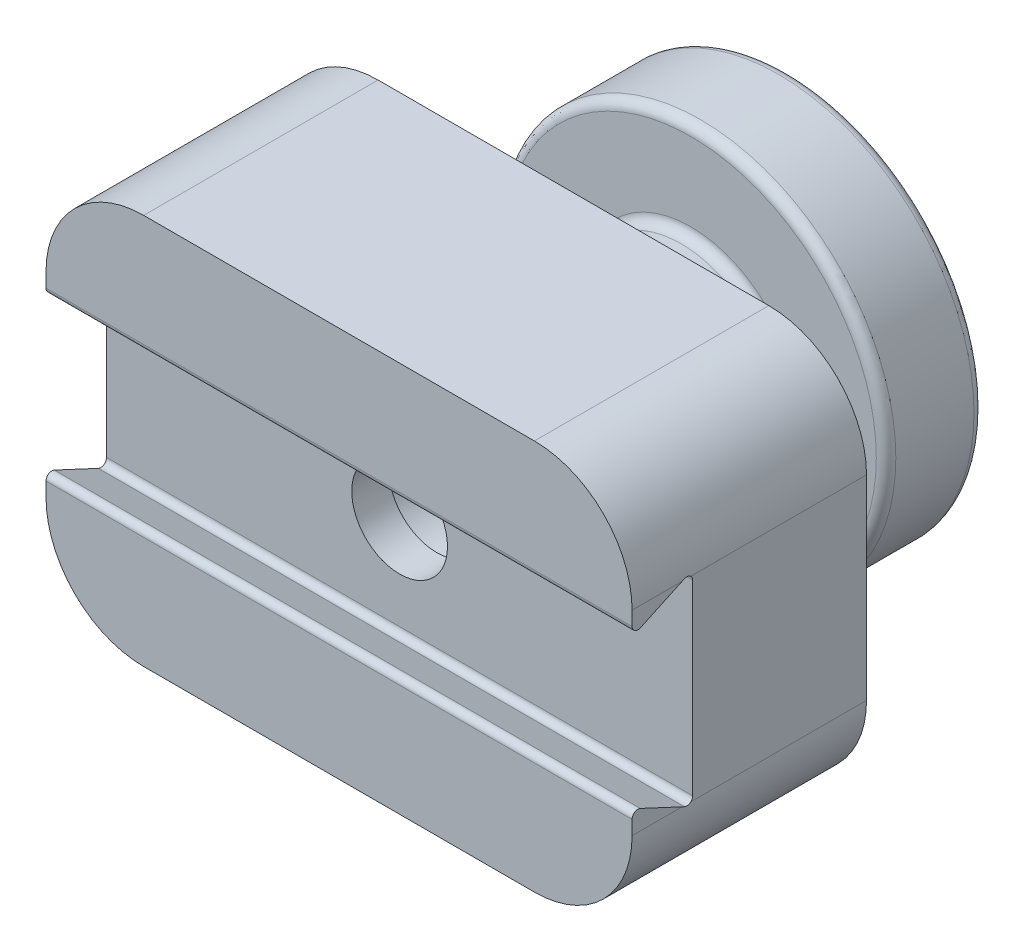
ISO-10303-21;
HEADER;
FILE_DESCRIPTION(('STEP AP214'),'2;1');
FILE_NAME('part.step','',(''),(''),'','','');
FILE_SCHEMA(('AUTOMOTIVE_DESIGN { 1 0 10303 214 1 1 1 1 }'));
ENDSEC;
DATA;
#1=APPLICATION_CONTEXT('core data for automotive mechanical design processes');
#2=APPLICATION_PROTOCOL_DEFINITION('international standard','automotive_design',2000,#1);
#3=PRODUCT_CONTEXT('',#1,'mechanical');
#4=PRODUCT('Part','Part','',(#3));
#5=PRODUCT_RELATED_PRODUCT_CATEGORY('part','',(#4));
#6=PRODUCT_DEFINITION_FORMATION('','',#4);
#7=PRODUCT_DEFINITION_CONTEXT('part definition',#1,'design');
#8=PRODUCT_DEFINITION('design','',#6,#7);
#9=PRODUCT_DEFINITION_SHAPE('','',#8);
#10=(LENGTH_UNIT() NAMED_UNIT(*) SI_UNIT(.MILLI.,.METRE.));
#11=(NAMED_UNIT(*) PLANE_ANGLE_UNIT() SI_UNIT($,.RADIAN.));
#12=(NAMED_UNIT(*) SI_UNIT($,.STERADIAN.) SOLID_ANGLE_UNIT());
#13=UNCERTAINTY_MEASURE_WITH_UNIT(LENGTH_MEASURE(1.E-05),#10,'distance_accuracy_value','');
#14=(GEOMETRIC_REPRESENTATION_CONTEXT(3) GLOBAL_UNCERTAINTY_ASSIGNED_CONTEXT((#13)) GLOBAL_UNIT_ASSIGNED_CONTEXT((#10,
#11,#12)) REPRESENTATION_CONTEXT('',''));
#15=CARTESIAN_POINT('',(0.,0.,0.));
#16=DIRECTION('',(0.,0.,1.));
#17=DIRECTION('',(1.,0.,0.));
#18=AXIS2_PLACEMENT_3D('',#15,#16,#17);
#19=CARTESIAN_POINT('',(-15.,10.,23.));
#20=DIRECTION('',(1.,0.,0.));
#21=DIRECTION('',(0.,1.,0.));
#22=AXIS2_PLACEMENT_3D('',#19,#20,#21);
#23=PLANE('',#22);
#24=DIRECTION('',(0.,-1.,0.));
#25=VECTOR('',#24,1.);
#26=CARTESIAN_POINT('',(-15.,10.,23.));
#27=LINE('',#26,#25);
#28=CARTESIAN_POINT('',(-15.,5.,23.));
#29=VERTEX_POINT('',#28);
#30=CARTESIAN_POINT('',(-15.,4.27535193285474,23.));
#31=VERTEX_POINT('',#30);
#32=EDGE_CURVE('E511',#29,#31,#27,.T.);
#33=ORIENTED_EDGE('',*,*,#32,.F.);
#34=DIRECTION('',(0.,0.,-1.));
#35=VECTOR('',#34,1.);
#36=CARTESIAN_POINT('',(-15.,5.,23.));
#37=LINE('',#36,#35);
#38=CARTESIAN_POINT('',(-15.,5.,20.4361267301274));
#39=VERTEX_POINT('',#38);
#40=EDGE_CURVE('E358',#29,#39,#37,.T.);
#41=ORIENTED_EDGE('',*,*,#40,.T.);
#42=DIRECTION('',(0.,-0.422618261740704,0.906307787036648));
#43=VECTOR('',#42,1.);
#44=CARTESIAN_POINT('',(-15.,3.80444625971949,23.));
#45=LINE('',#44,#43);
#46=CARTESIAN_POINT('',(-15.,4.00345959674374,22.5732145214778));
#47=VERTEX_POINT('',#46);
#48=EDGE_CURVE('E202',#39,#47,#45,.T.);
#49=ORIENTED_EDGE('',*,*,#48,.T.);
#50=CARTESIAN_POINT('',(-15.,4.27535193285474,22.7));
#51=DIRECTION('',(1.,0.,0.));
#52=DIRECTION('',(0.,1.,0.));
#53=AXIS2_PLACEMENT_3D('',#50,#51,#52);
#54=CIRCLE('',#53,0.3);
#55=EDGE_CURVE('E507',#47,#31,#54,.F.);
#56=ORIENTED_EDGE('',*,*,#55,.T.);
#57=EDGE_LOOP('',(#33,#41,#49,#56));
#58=FACE_BOUND('',#57,.T.);
#59=ADVANCED_FACE('F41',(#58),#23,.F.);
#60=CARTESIAN_POINT('',(-15.,4.77909432686475,20.2));
#61=DIRECTION('',(1.,0.,0.));
#62=DIRECTION('',(0.,1.,0.));
#63=AXIS2_PLACEMENT_3D('',#60,#61,#62);
#64=CIRCLE('',#63,0.3);
#65=CARTESIAN_POINT('',(-15.,4.77909432686475,19.9));
#66=VERTEX_POINT('',#65);
#67=CARTESIAN_POINT('',(-15.,5.,19.9970204848349));
#68=VERTEX_POINT('',#67);
#69=EDGE_CURVE('E227',#66,#68,#64,.T.);
#70=ORIENTED_EDGE('',*,*,#69,.T.);
#71=DIRECTION('',(0.,0.,-1.));
#72=VECTOR('',#71,1.);
#73=CARTESIAN_POINT('',(-15.,5.,23.));
#74=LINE('',#73,#72);
#75=CARTESIAN_POINT('',(-15.,5.,11.));
#76=VERTEX_POINT('',#75);
#77=EDGE_CURVE('E352',#68,#76,#74,.T.);
#78=ORIENTED_EDGE('',*,*,#77,.T.);
#79=DIRECTION('',(0.,-1.,0.));
#80=VECTOR('',#79,1.);
#81=CARTESIAN_POINT('',(-15.,10.,11.));
#82=LINE('',#81,#80);
#83=CARTESIAN_POINT('',(-15.,-5.,11.));
#84=VERTEX_POINT('',#83);
#85=EDGE_CURVE('E489',#76,#84,#82,.T.);
#86=ORIENTED_EDGE('',*,*,#85,.T.);
#87=DIRECTION('',(0.,0.,-1.));
#88=VECTOR('',#87,1.);
#89=CARTESIAN_POINT('',(-15.,-5.,23.));
#90=LINE('',#89,#88);
#91=CARTESIAN_POINT('',(-15.,-5.,19.9970204848349));
#92=VERTEX_POINT('',#91);
#93=EDGE_CURVE('E349',#84,#92,#90,.F.);
#94=ORIENTED_EDGE('',*,*,#93,.T.);
#95=CARTESIAN_POINT('',(-15.,-4.77909432686475,20.2));
#96=DIRECTION('',(1.,0.,0.));
#97=DIRECTION('',(0.,1.,0.));
#98=AXIS2_PLACEMENT_3D('',#95,#96,#97);
#99=CIRCLE('',#98,0.3);
#100=CARTESIAN_POINT('',(-15.,-4.77909432686474,19.9));
#101=VERTEX_POINT('',#100);
#102=EDGE_CURVE('E222',#92,#101,#99,.T.);
#103=ORIENTED_EDGE('',*,*,#102,.T.);
#104=DIRECTION('',(0.,1.,0.));
#105=VECTOR('',#104,1.);
#106=CARTESIAN_POINT('',(-15.,5.25,19.9));
#107=LINE('',#106,#105);
#108=EDGE_CURVE('E341',#101,#66,#107,.T.);
#109=ORIENTED_EDGE('',*,*,#108,.T.);
#110=EDGE_LOOP('',(#70,#78,#86,#94,#103,#109));
#111=FACE_BOUND('',#110,.T.);
#112=ADVANCED_FACE('F312',(#111),#23,.F.);
#113=CARTESIAN_POINT('',(15.,10.,23.));
#114=DIRECTION('',(-1.,0.,0.));
#115=DIRECTION('',(0.,-1.,0.));
#116=AXIS2_PLACEMENT_3D('',#113,#114,#115);
#117=PLANE('',#116);
#118=DIRECTION('',(0.,1.,0.));
#119=VECTOR('',#118,1.);
#120=CARTESIAN_POINT('',(15.,10.,23.));
#121=LINE('',#120,#119);
#122=CARTESIAN_POINT('',(15.,-5.,23.));
#123=VERTEX_POINT('',#122);
#124=CARTESIAN_POINT('',(15.,-4.27535193285473,23.));
#125=VERTEX_POINT('',#124);
#126=EDGE_CURVE('E442',#123,#125,#121,.T.);
#127=ORIENTED_EDGE('',*,*,#126,.F.);
#128=DIRECTION('',(0.,0.,-1.));
#129=VECTOR('',#128,1.);
#130=CARTESIAN_POINT('',(15.,-5.,23.));
#131=LINE('',#130,#129);
#132=CARTESIAN_POINT('',(15.,-5.,20.4361267301274));
#133=VERTEX_POINT('',#132);
#134=EDGE_CURVE('E200',#123,#133,#131,.T.);
#135=ORIENTED_EDGE('',*,*,#134,.T.);
#136=DIRECTION('',(0.,-0.422618261740705,-0.906307787036648));
#137=VECTOR('',#136,1.);
#138=CARTESIAN_POINT('',(15.,-5.25,19.9));
#139=LINE('',#138,#137);
#140=CARTESIAN_POINT('',(15.,-4.00345959674374,22.5732145214778));
#141=VERTEX_POINT('',#140);
#142=EDGE_CURVE('E184',#141,#133,#139,.T.);
#143=ORIENTED_EDGE('',*,*,#142,.F.);
#144=CARTESIAN_POINT('',(15.,-4.27535193285473,22.7));
#145=DIRECTION('',(-1.,0.,0.));
#146=DIRECTION('',(0.,-1.,0.));
#147=AXIS2_PLACEMENT_3D('',#144,#145,#146);
#148=CIRCLE('',#147,0.3);
#149=EDGE_CURVE('E197',#141,#125,#148,.F.);
#150=ORIENTED_EDGE('',*,*,#149,.T.);
#151=EDGE_LOOP('',(#127,#135,#143,#150));
#152=FACE_BOUND('',#151,.T.);
#153=ADVANCED_FACE('F196',(#152),#117,.F.);
#154=CARTESIAN_POINT('',(15.,-4.77909432686475,20.2));
#155=DIRECTION('',(-1.,0.,0.));
#156=DIRECTION('',(0.,-1.,0.));
#157=AXIS2_PLACEMENT_3D('',#154,#155,#156);
#158=CIRCLE('',#157,0.3);
#159=CARTESIAN_POINT('',(15.,-4.77909432686474,19.9));
#160=VERTEX_POINT('',#159);
#161=CARTESIAN_POINT('',(15.,-5.,19.9970204848349));
#162=VERTEX_POINT('',#161);
#163=EDGE_CURVE('E224',#160,#162,#158,.T.);
#164=ORIENTED_EDGE('',*,*,#163,.T.);
#165=DIRECTION('',(0.,0.,-1.));
#166=VECTOR('',#165,1.);
#167=CARTESIAN_POINT('',(15.,-5.,23.));
#168=LINE('',#167,#166);
#169=CARTESIAN_POINT('',(15.,-5.,11.));
#170=VERTEX_POINT('',#169);
#171=EDGE_CURVE('E236',#162,#170,#168,.T.);
#172=ORIENTED_EDGE('',*,*,#171,.T.);
#173=DIRECTION('',(0.,1.,0.));
#174=VECTOR('',#173,1.);
#175=CARTESIAN_POINT('',(15.,10.,11.));
#176=LINE('',#175,#174);
#177=CARTESIAN_POINT('',(15.,5.,11.));
#178=VERTEX_POINT('',#177);
#179=EDGE_CURVE('E485',#170,#178,#176,.T.);
#180=ORIENTED_EDGE('',*,*,#179,.T.);
#181=DIRECTION('',(0.,0.,-1.));
#182=VECTOR('',#181,1.);
#183=CARTESIAN_POINT('',(15.,5.,23.));
#184=LINE('',#183,#182);
#185=CARTESIAN_POINT('',(15.,5.,19.9970204848349));
#186=VERTEX_POINT('',#185);
#187=EDGE_CURVE('E234',#178,#186,#184,.F.);
#188=ORIENTED_EDGE('',*,*,#187,.T.);
#189=CARTESIAN_POINT('',(15.,4.77909432686475,20.2));
#190=DIRECTION('',(-1.,0.,0.));
#191=DIRECTION('',(0.,-1.,0.));
#192=AXIS2_PLACEMENT_3D('',#189,#190,#191);
#193=CIRCLE('',#192,0.3);
#194=CARTESIAN_POINT('',(15.,4.77909432686475,19.9));
#195=VERTEX_POINT('',#194);
#196=EDGE_CURVE('E230',#186,#195,#193,.T.);
#197=ORIENTED_EDGE('',*,*,#196,.T.);
#198=DIRECTION('',(0.,1.,0.));
#199=VECTOR('',#198,1.);
#200=CARTESIAN_POINT('',(15.,5.25,19.9));
#201=LINE('',#200,#199);
#202=EDGE_CURVE('E201',#160,#195,#201,.T.);
#203=ORIENTED_EDGE('',*,*,#202,.F.);
#204=EDGE_LOOP('',(#164,#172,#180,#188,#197,#203));
#205=FACE_BOUND('',#204,.T.);
#206=ADVANCED_FACE('F334',(#205),#117,.F.);
#207=DIRECTION('',(0.,-0.422618261740704,0.906307787036648));
#208=VECTOR('',#207,1.);
#209=CARTESIAN_POINT('',(15.,3.80444625971949,23.));
#210=LINE('',#209,#208);
#211=CARTESIAN_POINT('',(15.,5.,20.4361267301274));
#212=VERTEX_POINT('',#211);
#213=CARTESIAN_POINT('',(15.,4.00345959674374,22.5732145214778));
#214=VERTEX_POINT('',#213);
#215=EDGE_CURVE('E518',#212,#214,#210,.T.);
#216=ORIENTED_EDGE('',*,*,#215,.F.);
#217=DIRECTION('',(0.,0.,-1.));
#218=VECTOR('',#217,1.);
#219=CARTESIAN_POINT('',(15.,5.,23.));
#220=LINE('',#219,#218);
#221=CARTESIAN_POINT('',(15.,5.,23.));
#222=VERTEX_POINT('',#221);
#223=EDGE_CURVE('E232',#212,#222,#220,.F.);
#224=ORIENTED_EDGE('',*,*,#223,.T.);
#225=CARTESIAN_POINT('',(15.,4.27535193285474,23.));
#226=VERTEX_POINT('',#225);
#227=EDGE_CURVE('E488',#226,#222,#121,.T.);
#228=ORIENTED_EDGE('',*,*,#227,.F.);
#229=CARTESIAN_POINT('',(15.,4.27535193285474,22.7));
#230=DIRECTION('',(-1.,0.,0.));
#231=DIRECTION('',(0.,-1.,0.));
#232=AXIS2_PLACEMENT_3D('',#229,#230,#231);
#233=CIRCLE('',#232,0.3);
#234=EDGE_CURVE('E208',#226,#214,#233,.F.);
#235=ORIENTED_EDGE('',*,*,#234,.T.);
#236=EDGE_LOOP('',(#216,#224,#228,#235));
#237=FACE_BOUND('',#236,.T.);
#238=ADVANCED_FACE('F325',(#237),#117,.F.);
#239=DIRECTION('',(0.,-0.422618261740705,-0.906307787036648));
#240=VECTOR('',#239,1.);
#241=CARTESIAN_POINT('',(-15.,-5.25,19.9));
#242=LINE('',#241,#240);
#243=CARTESIAN_POINT('',(-15.,-4.00345959674374,22.5732145214778));
#244=VERTEX_POINT('',#243);
#245=CARTESIAN_POINT('',(-15.,-5.,20.4361267301274));
#246=VERTEX_POINT('',#245);
#247=EDGE_CURVE('E186',#244,#246,#242,.T.);
#248=ORIENTED_EDGE('',*,*,#247,.T.);
#249=DIRECTION('',(0.,0.,-1.));
#250=VECTOR('',#249,1.);
#251=CARTESIAN_POINT('',(-15.,-5.,23.));
#252=LINE('',#251,#250);
#253=CARTESIAN_POINT('',(-15.,-5.,23.));
#254=VERTEX_POINT('',#253);
#255=EDGE_CURVE('E339',#246,#254,#252,.F.);
#256=ORIENTED_EDGE('',*,*,#255,.T.);
#257=CARTESIAN_POINT('',(-15.,-4.27535193285473,23.));
#258=VERTEX_POINT('',#257);
#259=EDGE_CURVE('E441',#258,#254,#27,.T.);
#260=ORIENTED_EDGE('',*,*,#259,.F.);
#261=CARTESIAN_POINT('',(-15.,-4.27535193285473,22.7));
#262=DIRECTION('',(1.,0.,0.));
#263=DIRECTION('',(0.,1.,0.));
#264=AXIS2_PLACEMENT_3D('',#261,#262,#263);
#265=CIRCLE('',#264,0.3);
#266=EDGE_CURVE('E214',#258,#244,#265,.F.);
#267=ORIENTED_EDGE('',*,*,#266,.T.);
#268=EDGE_LOOP('',(#248,#256,#260,#267));
#269=FACE_BOUND('',#268,.T.);
#270=ADVANCED_FACE('F315',(#269),#23,.F.);
#271=CARTESIAN_POINT('',(0.,0.,23.));
#272=DIRECTION('',(0.,0.,1.));
#273=DIRECTION('',(1.,0.,0.));
#274=AXIS2_PLACEMENT_3D('',#271,#272,#273);
#275=PLANE('',#274);
#276=DIRECTION('',(1.,0.,0.));
#277=VECTOR('',#276,1.);
#278=CARTESIAN_POINT('',(-15.,-10.,23.));
#279=LINE('',#278,#277);
#280=CARTESIAN_POINT('',(-10.,-10.,23.));
#281=VERTEX_POINT('',#280);
#282=CARTESIAN_POINT('',(9.99999999999999,-10.,23.));
#283=VERTEX_POINT('',#282);
#284=EDGE_CURVE('E190',#281,#283,#279,.T.);
#285=ORIENTED_EDGE('',*,*,#284,.T.);
#286=CARTESIAN_POINT('',(9.99999999999999,-5.,23.));
#287=DIRECTION('',(0.,0.,1.));
#288=DIRECTION('',(1.,0.,0.));
#289=AXIS2_PLACEMENT_3D('',#286,#287,#288);
#290=CIRCLE('',#289,5.);
#291=EDGE_CURVE('E449',#283,#123,#290,.T.);
#292=ORIENTED_EDGE('',*,*,#291,.T.);
#293=ORIENTED_EDGE('',*,*,#126,.T.);
#294=DIRECTION('',(-1.,0.,0.));
#295=VECTOR('',#294,1.);
#296=CARTESIAN_POINT('',(0.,-4.27535193285473,23.));
#297=LINE('',#296,#295);
#298=EDGE_CURVE('E206',#125,#258,#297,.T.);
#299=ORIENTED_EDGE('',*,*,#298,.T.);
#300=ORIENTED_EDGE('',*,*,#259,.T.);
#301=CARTESIAN_POINT('',(-10.,-5.,23.));
#302=DIRECTION('',(0.,0.,1.));
#303=DIRECTION('',(1.,0.,0.));
#304=AXIS2_PLACEMENT_3D('',#301,#302,#303);
#305=CIRCLE('',#304,5.);
#306=EDGE_CURVE('E348',#254,#281,#305,.T.);
#307=ORIENTED_EDGE('',*,*,#306,.T.);
#308=EDGE_LOOP('',(#285,#292,#293,#299,#300,#307));
#309=FACE_BOUND('',#308,.T.);
#310=ADVANCED_FACE('F324',(#309),#275,.T.);
#311=ORIENTED_EDGE('',*,*,#227,.T.);
#312=CARTESIAN_POINT('',(9.99999999999999,5.,23.));
#313=DIRECTION('',(0.,0.,1.));
#314=DIRECTION('',(1.,0.,0.));
#315=AXIS2_PLACEMENT_3D('',#312,#313,#314);
#316=CIRCLE('',#315,5.);
#317=CARTESIAN_POINT('',(9.99999999999999,10.,23.));
#318=VERTEX_POINT('',#317);
#319=EDGE_CURVE('E350',#222,#318,#316,.T.);
#320=ORIENTED_EDGE('',*,*,#319,.T.);
#321=DIRECTION('',(-1.,0.,0.));
#322=VECTOR('',#321,1.);
#323=CARTESIAN_POINT('',(-15.,10.,23.));
#324=LINE('',#323,#322);
#325=CARTESIAN_POINT('',(-10.,10.,23.));
#326=VERTEX_POINT('',#325);
#327=EDGE_CURVE('E434',#318,#326,#324,.T.);
#328=ORIENTED_EDGE('',*,*,#327,.T.);
#329=CARTESIAN_POINT('',(-10.,5.,23.));
#330=DIRECTION('',(0.,0.,1.));
#331=DIRECTION('',(1.,0.,0.));
#332=AXIS2_PLACEMENT_3D('',#329,#330,#331);
#333=CIRCLE('',#332,5.);
#334=EDGE_CURVE('E56',#326,#29,#333,.T.);
#335=ORIENTED_EDGE('',*,*,#334,.T.);
#336=ORIENTED_EDGE('',*,*,#32,.T.);
#337=DIRECTION('',(-1.,0.,0.));
#338=VECTOR('',#337,1.);
#339=CARTESIAN_POINT('',(0.,4.27535193285474,23.));
#340=LINE('',#339,#338);
#341=EDGE_CURVE('E220',#31,#226,#340,.F.);
#342=ORIENTED_EDGE('',*,*,#341,.T.);
#343=EDGE_LOOP('',(#311,#320,#328,#335,#336,#342));
#344=FACE_BOUND('',#343,.T.);
#345=ADVANCED_FACE('F331',(#344),#275,.T.);
#346=CARTESIAN_POINT('',(0.,0.,5.));
#347=DIRECTION('',(0.,0.,-1.));
#348=DIRECTION('',(-1.,0.,0.));
#349=AXIS2_PLACEMENT_3D('',#346,#347,#348);
#350=CYLINDRICAL_SURFACE('',#349,10.);
#351=CARTESIAN_POINT('',(0.,0.,0.5));
#352=DIRECTION('',(0.,0.,-1.));
#353=DIRECTION('',(-1.,0.,0.));
#354=AXIS2_PLACEMENT_3D('',#351,#352,#353);
#355=CIRCLE('',#354,10.);
#356=CARTESIAN_POINT('',(-10.,0.,0.5));
#357=VERTEX_POINT('',#356);
#358=EDGE_CURVE('E363',#357,#357,#355,.F.);
#359=ORIENTED_EDGE('',*,*,#358,.T.);
#360=EDGE_LOOP('',(#359));
#361=FACE_BOUND('',#360,.T.);
#362=CARTESIAN_POINT('',(0.,0.,4.5));
#363=DIRECTION('',(0.,0.,-1.));
#364=DIRECTION('',(-1.,0.,0.));
#365=AXIS2_PLACEMENT_3D('',#362,#363,#364);
#366=CIRCLE('',#365,10.);
#367=CARTESIAN_POINT('',(-10.,0.,4.5));
#368=VERTEX_POINT('',#367);
#369=EDGE_CURVE('E360',#368,#368,#366,.T.);
#370=ORIENTED_EDGE('',*,*,#369,.T.);
#371=EDGE_LOOP('',(#370));
#372=FACE_BOUND('',#371,.T.);
#373=ADVANCED_FACE('F269',(#361,#372),#350,.T.);
#374=CARTESIAN_POINT('',(0.,0.,5.));
#375=DIRECTION('',(0.,0.,-1.));
#376=DIRECTION('',(-1.,0.,0.));
#377=AXIS2_PLACEMENT_3D('',#374,#375,#376);
#378=PLANE('',#377);
#379=CARTESIAN_POINT('',(0.,0.,5.));
#380=DIRECTION('',(0.,0.,-1.));
#381=DIRECTION('',(-1.,0.,0.));
#382=AXIS2_PLACEMENT_3D('',#379,#380,#381);
#383=CIRCLE('',#382,9.5);
#384=CARTESIAN_POINT('',(-9.5,0.,5.));
#385=VERTEX_POINT('',#384);
#386=EDGE_CURVE('E372',#385,#385,#383,.F.);
#387=ORIENTED_EDGE('',*,*,#386,.T.);
#388=EDGE_LOOP('',(#387));
#389=FACE_BOUND('',#388,.T.);
#390=CARTESIAN_POINT('',(0.,0.,5.));
#391=DIRECTION('',(0.,0.,-1.));
#392=DIRECTION('',(-1.,0.,0.));
#393=AXIS2_PLACEMENT_3D('',#390,#391,#392);
#394=CIRCLE('',#393,5.5);
#395=CARTESIAN_POINT('',(-5.5,0.,5.));
#396=VERTEX_POINT('',#395);
#397=EDGE_CURVE('E369',#396,#396,#394,.T.);
#398=ORIENTED_EDGE('',*,*,#397,.T.);
#399=EDGE_LOOP('',(#398));
#400=FACE_BOUND('',#399,.T.);
#401=ADVANCED_FACE('F407',(#389,#400),#378,.F.);
#402=CARTESIAN_POINT('',(0.,0.,0.));
#403=DIRECTION('',(0.,0.,-1.));
#404=DIRECTION('',(-1.,0.,0.));
#405=AXIS2_PLACEMENT_3D('',#402,#403,#404);
#406=PLANE('',#405);
#407=CARTESIAN_POINT('',(0.,0.,0.));
#408=DIRECTION('',(0.,0.,-1.));
#409=DIRECTION('',(-1.,0.,0.));
#410=AXIS2_PLACEMENT_3D('',#407,#408,#409);
#411=CIRCLE('',#410,9.5);
#412=CARTESIAN_POINT('',(-9.5,0.,0.));
#413=VERTEX_POINT('',#412);
#414=EDGE_CURVE('E366',#413,#413,#411,.T.);
#415=ORIENTED_EDGE('',*,*,#414,.T.);
#416=EDGE_LOOP('',(#415));
#417=FACE_BOUND('',#416,.T.);
#418=ADVANCED_FACE('F414',(#417),#406,.T.);
#419=CARTESIAN_POINT('',(0.,0.,11.));
#420=DIRECTION('',(0.,0.,-1.));
#421=DIRECTION('',(-1.,0.,0.));
#422=AXIS2_PLACEMENT_3D('',#419,#420,#421);
#423=CYLINDRICAL_SURFACE('',#422,5.);
#424=CARTESIAN_POINT('',(0.,0.,5.5));
#425=DIRECTION('',(0.,0.,-1.));
#426=DIRECTION('',(-1.,0.,0.));
#427=AXIS2_PLACEMENT_3D('',#424,#425,#426);
#428=CIRCLE('',#427,5.);
#429=CARTESIAN_POINT('',(-5.,0.,5.5));
#430=VERTEX_POINT('',#429);
#431=EDGE_CURVE('E49',#430,#430,#428,.F.);
#432=ORIENTED_EDGE('',*,*,#431,.T.);
#433=EDGE_LOOP('',(#432));
#434=FACE_BOUND('',#433,.T.);
#435=CARTESIAN_POINT('',(0.,0.,10.5));
#436=DIRECTION('',(0.,0.,1.));
#437=DIRECTION('',(1.,0.,0.));
#438=AXIS2_PLACEMENT_3D('',#435,#436,#437);
#439=CIRCLE('',#438,5.);
#440=CARTESIAN_POINT('',(5.,0.,10.5));
#441=VERTEX_POINT('',#440);
#442=EDGE_CURVE('E375',#441,#441,#439,.F.);
#443=ORIENTED_EDGE('',*,*,#442,.T.);
#444=EDGE_LOOP('',(#443));
#445=FACE_BOUND('',#444,.T.);
#446=ADVANCED_FACE('F380',(#434,#445),#423,.T.);
#447=CARTESIAN_POINT('',(-15.,10.,23.));
#448=DIRECTION('',(0.,-1.,0.));
#449=DIRECTION('',(0.,0.,-1.));
#450=AXIS2_PLACEMENT_3D('',#447,#448,#449);
#451=PLANE('',#450);
#452=ORIENTED_EDGE('',*,*,#327,.F.);
#453=DIRECTION('',(0.,0.,-1.));
#454=VECTOR('',#453,1.);
#455=CARTESIAN_POINT('',(9.99999999999999,10.,23.));
#456=LINE('',#455,#454);
#457=CARTESIAN_POINT('',(9.99999999999999,10.,11.));
#458=VERTEX_POINT('',#457);
#459=EDGE_CURVE('E437',#318,#458,#456,.T.);
#460=ORIENTED_EDGE('',*,*,#459,.T.);
#461=DIRECTION('',(-1.,0.,0.));
#462=VECTOR('',#461,1.);
#463=CARTESIAN_POINT('',(-15.,10.,11.));
#464=LINE('',#463,#462);
#465=CARTESIAN_POINT('',(-10.,10.,11.));
#466=VERTEX_POINT('',#465);
#467=EDGE_CURVE('E493',#458,#466,#464,.T.);
#468=ORIENTED_EDGE('',*,*,#467,.T.);
#469=DIRECTION('',(0.,0.,-1.));
#470=VECTOR('',#469,1.);
#471=CARTESIAN_POINT('',(-10.,10.,23.));
#472=LINE('',#471,#470);
#473=EDGE_CURVE('E440',#466,#326,#472,.F.);
#474=ORIENTED_EDGE('',*,*,#473,.T.);
#475=EDGE_LOOP('',(#452,#460,#468,#474));
#476=FACE_BOUND('',#475,.T.);
#477=ADVANCED_FACE('F422',(#476),#451,.F.);
#478=CARTESIAN_POINT('',(-15.,-10.,23.));
#479=DIRECTION('',(0.,1.,0.));
#480=DIRECTION('',(0.,0.,1.));
#481=AXIS2_PLACEMENT_3D('',#478,#479,#480);
#482=PLANE('',#481);
#483=DIRECTION('',(1.,0.,0.));
#484=VECTOR('',#483,1.);
#485=CARTESIAN_POINT('',(-15.,-10.,11.));
#486=LINE('',#485,#484);
#487=CARTESIAN_POINT('',(-10.,-10.,11.));
#488=VERTEX_POINT('',#487);
#489=CARTESIAN_POINT('',(9.99999999999999,-10.,11.));
#490=VERTEX_POINT('',#489);
#491=EDGE_CURVE('E484',#488,#490,#486,.T.);
#492=ORIENTED_EDGE('',*,*,#491,.T.);
#493=DIRECTION('',(0.,0.,-1.));
#494=VECTOR('',#493,1.);
#495=CARTESIAN_POINT('',(9.99999999999999,-10.,23.));
#496=LINE('',#495,#494);
#497=EDGE_CURVE('E454',#490,#283,#496,.F.);
#498=ORIENTED_EDGE('',*,*,#497,.T.);
#499=ORIENTED_EDGE('',*,*,#284,.F.);
#500=DIRECTION('',(0.,0.,-1.));
#501=VECTOR('',#500,1.);
#502=CARTESIAN_POINT('',(-10.,-10.,23.));
#503=LINE('',#502,#501);
#504=EDGE_CURVE('E456',#281,#488,#503,.T.);
#505=ORIENTED_EDGE('',*,*,#504,.T.);
#506=EDGE_LOOP('',(#492,#498,#499,#505));
#507=FACE_BOUND('',#506,.T.);
#508=ADVANCED_FACE('F424',(#507),#482,.F.);
#509=CARTESIAN_POINT('',(0.,0.,11.));
#510=DIRECTION('',(0.,0.,1.));
#511=DIRECTION('',(1.,0.,0.));
#512=AXIS2_PLACEMENT_3D('',#509,#510,#511);
#513=PLANE('',#512);
#514=CARTESIAN_POINT('',(0.,0.,11.));
#515=DIRECTION('',(0.,0.,1.));
#516=DIRECTION('',(1.,0.,0.));
#517=AXIS2_PLACEMENT_3D('',#514,#515,#516);
#518=CIRCLE('',#517,5.5);
#519=CARTESIAN_POINT('',(5.5,0.,11.));
#520=VERTEX_POINT('',#519);
#521=EDGE_CURVE('E11',#520,#520,#518,.T.);
#522=ORIENTED_EDGE('',*,*,#521,.T.);
#523=EDGE_LOOP('',(#522));
#524=FACE_BOUND('',#523,.T.);
#525=ORIENTED_EDGE('',*,*,#179,.F.);
#526=CARTESIAN_POINT('',(9.99999999999999,-5.,11.));
#527=DIRECTION('',(0.,0.,1.));
#528=DIRECTION('',(1.,0.,0.));
#529=AXIS2_PLACEMENT_3D('',#526,#527,#528);
#530=CIRCLE('',#529,5.);
#531=EDGE_CURVE('E459',#170,#490,#530,.F.);
#532=ORIENTED_EDGE('',*,*,#531,.T.);
#533=ORIENTED_EDGE('',*,*,#491,.F.);
#534=CARTESIAN_POINT('',(-10.,-5.,11.));
#535=DIRECTION('',(0.,0.,1.));
#536=DIRECTION('',(1.,0.,0.));
#537=AXIS2_PLACEMENT_3D('',#534,#535,#536);
#538=CIRCLE('',#537,5.);
#539=EDGE_CURVE('E463',#488,#84,#538,.F.);
#540=ORIENTED_EDGE('',*,*,#539,.T.);
#541=ORIENTED_EDGE('',*,*,#85,.F.);
#542=CARTESIAN_POINT('',(-10.,5.,11.));
#543=DIRECTION('',(0.,0.,1.));
#544=DIRECTION('',(1.,0.,0.));
#545=AXIS2_PLACEMENT_3D('',#542,#543,#544);
#546=CIRCLE('',#545,5.);
#547=EDGE_CURVE('E462',#76,#466,#546,.F.);
#548=ORIENTED_EDGE('',*,*,#547,.T.);
#549=ORIENTED_EDGE('',*,*,#467,.F.);
#550=CARTESIAN_POINT('',(9.99999999999999,5.,11.));
#551=DIRECTION('',(0.,0.,1.));
#552=DIRECTION('',(1.,0.,0.));
#553=AXIS2_PLACEMENT_3D('',#550,#551,#552);
#554=CIRCLE('',#553,5.);
#555=EDGE_CURVE('E448',#458,#178,#554,.F.);
#556=ORIENTED_EDGE('',*,*,#555,.T.);
#557=EDGE_LOOP('',(#525,#532,#533,#540,#541,#548,#549,#556));
#558=FACE_BOUND('',#557,.T.);
#559=ADVANCED_FACE('F430',(#524,#558),#513,.F.);
#560=CARTESIAN_POINT('',(15.,-5.25,19.9));
#561=DIRECTION('',(0.,0.906307787036648,-0.422618261740705));
#562=DIRECTION('',(0.,0.422618261740705,0.906307787036648));
#563=AXIS2_PLACEMENT_3D('',#560,#561,#562);
#564=PLANE('',#563);
#565=ORIENTED_EDGE('',*,*,#142,.T.);
#566=CARTESIAN_POINT('',(9.99999999999999,-5.,20.4361267301274));
#567=DIRECTION('',(0.,0.906307787036648,-0.422618261740705));
#568=DIRECTION('',(0.,-0.422618261740705,-0.906307787036648));
#569=AXIS2_PLACEMENT_3D('',#566,#567,#568);
#570=ELLIPSE('',#569,11.8310079157623,5.);
#571=CARTESIAN_POINT('',(14.9997400292614,-5.05098666297574,20.3267854785222));
#572=VERTEX_POINT('',#571);
#573=EDGE_CURVE('E241',#133,#572,#570,.T.);
#574=ORIENTED_EDGE('',*,*,#573,.T.);
#575=DIRECTION('',(-1.,0.,0.));
#576=VECTOR('',#575,1.);
#577=CARTESIAN_POINT('',(-15.,-5.05098666297574,20.3267854785222));
#578=LINE('',#577,#576);
#579=CARTESIAN_POINT('',(-14.9997400292614,-5.05098666297574,20.3267854785222));
#580=VERTEX_POINT('',#579);
#581=EDGE_CURVE('E189',#572,#580,#578,.T.);
#582=ORIENTED_EDGE('',*,*,#581,.T.);
#583=CARTESIAN_POINT('',(-10.,-5.,20.4361267301274));
#584=DIRECTION('',(0.,0.906307787036648,-0.422618261740705));
#585=DIRECTION('',(0.,-0.422618261740705,-0.906307787036648));
#586=AXIS2_PLACEMENT_3D('',#583,#584,#585);
#587=ELLIPSE('',#586,11.8310079157623,5.);
#588=EDGE_CURVE('E239',#580,#246,#587,.T.);
#589=ORIENTED_EDGE('',*,*,#588,.T.);
#590=ORIENTED_EDGE('',*,*,#247,.F.);
#591=DIRECTION('',(-1.,0.,0.));
#592=VECTOR('',#591,1.);
#593=CARTESIAN_POINT('',(15.,-4.00345959674374,22.5732145214778));
#594=LINE('',#593,#592);
#595=EDGE_CURVE('E181',#244,#141,#594,.F.);
#596=ORIENTED_EDGE('',*,*,#595,.T.);
#597=EDGE_LOOP('',(#565,#574,#582,#589,#590,#596));
#598=FACE_BOUND('',#597,.T.);
#599=ADVANCED_FACE('F183',(#598),#564,.T.);
#600=CARTESIAN_POINT('',(15.,5.25,19.9));
#601=DIRECTION('',(0.,0.,1.));
#602=DIRECTION('',(0.,-1.,0.));
#603=AXIS2_PLACEMENT_3D('',#600,#601,#602);
#604=PLANE('',#603);
#605=CARTESIAN_POINT('',(0.,0.,19.9));
#606=DIRECTION('',(0.,0.,1.));
#607=DIRECTION('',(0.,-1.,0.));
#608=AXIS2_PLACEMENT_3D('',#605,#606,#607);
#609=CIRCLE('',#608,2.45);
#610=CARTESIAN_POINT('',(0.,-2.45,19.9));
#611=VERTEX_POINT('',#610);
#612=EDGE_CURVE('E342',#611,#611,#609,.T.);
#613=ORIENTED_EDGE('',*,*,#612,.F.);
#614=EDGE_LOOP('',(#613));
#615=FACE_BOUND('',#614,.T.);
#616=ORIENTED_EDGE('',*,*,#108,.F.);
#617=DIRECTION('',(-1.,0.,0.));
#618=VECTOR('',#617,1.);
#619=CARTESIAN_POINT('',(15.,-4.77909432686475,19.9));
#620=LINE('',#619,#618);
#621=EDGE_CURVE('E504',#101,#160,#620,.F.);
#622=ORIENTED_EDGE('',*,*,#621,.T.);
#623=ORIENTED_EDGE('',*,*,#202,.T.);
#624=DIRECTION('',(-1.,0.,0.));
#625=VECTOR('',#624,1.);
#626=CARTESIAN_POINT('',(-15.,4.77909432686475,19.9));
#627=LINE('',#626,#625);
#628=EDGE_CURVE('E501',#195,#66,#627,.T.);
#629=ORIENTED_EDGE('',*,*,#628,.T.);
#630=EDGE_LOOP('',(#616,#622,#623,#629));
#631=FACE_BOUND('',#630,.T.);
#632=ADVANCED_FACE('F567',(#615,#631),#604,.T.);
#633=CARTESIAN_POINT('',(15.,3.80444625971949,23.));
#634=DIRECTION('',(0.,-0.906307787036648,-0.422618261740704));
#635=DIRECTION('',(0.,0.422618261740704,-0.906307787036648));
#636=AXIS2_PLACEMENT_3D('',#633,#634,#635);
#637=PLANE('',#636);
#638=DIRECTION('',(-1.,0.,0.));
#639=VECTOR('',#638,1.);
#640=CARTESIAN_POINT('',(15.,5.05098666297575,20.3267854785222));
#641=LINE('',#640,#639);
#642=CARTESIAN_POINT('',(-14.9997400292614,5.05098666297575,20.3267854785222));
#643=VERTEX_POINT('',#642);
#644=CARTESIAN_POINT('',(14.9997400292614,5.05098666297575,20.3267854785222));
#645=VERTEX_POINT('',#644);
#646=EDGE_CURVE('E211',#643,#645,#641,.F.);
#647=ORIENTED_EDGE('',*,*,#646,.T.);
#648=CARTESIAN_POINT('',(9.99999999999999,5.,20.4361267301274));
#649=DIRECTION('',(0.,-0.906307787036648,-0.422618261740704));
#650=DIRECTION('',(0.,0.422618261740704,-0.906307787036648));
#651=AXIS2_PLACEMENT_3D('',#648,#649,#650);
#652=ELLIPSE('',#651,11.8310079157624,5.);
#653=EDGE_CURVE('E520',#645,#212,#652,.T.);
#654=ORIENTED_EDGE('',*,*,#653,.T.);
#655=ORIENTED_EDGE('',*,*,#215,.T.);
#656=DIRECTION('',(-1.,0.,0.));
#657=VECTOR('',#656,1.);
#658=CARTESIAN_POINT('',(15.,4.00345959674374,22.5732145214778));
#659=LINE('',#658,#657);
#660=EDGE_CURVE('E207',#214,#47,#659,.T.);
#661=ORIENTED_EDGE('',*,*,#660,.T.);
#662=ORIENTED_EDGE('',*,*,#48,.F.);
#663=CARTESIAN_POINT('',(-10.,5.,20.4361267301274));
#664=DIRECTION('',(0.,-0.906307787036648,-0.422618261740704));
#665=DIRECTION('',(0.,0.422618261740704,-0.906307787036648));
#666=AXIS2_PLACEMENT_3D('',#663,#664,#665);
#667=ELLIPSE('',#666,11.8310079157624,5.);
#668=EDGE_CURVE('E64',#39,#643,#667,.T.);
#669=ORIENTED_EDGE('',*,*,#668,.T.);
#670=EDGE_LOOP('',(#647,#654,#655,#661,#662,#669));
#671=FACE_BOUND('',#670,.T.);
#672=ADVANCED_FACE('F523',(#671),#637,.T.);
#673=CARTESIAN_POINT('',(0.,0.,18.));
#674=DIRECTION('',(0.,0.,1.));
#675=DIRECTION('',(1.,0.,0.));
#676=AXIS2_PLACEMENT_3D('',#673,#674,#675);
#677=CYLINDRICAL_SURFACE('',#676,2.45);
#678=ORIENTED_EDGE('',*,*,#612,.T.);
#679=EDGE_LOOP('',(#678));
#680=FACE_BOUND('',#679,.T.);
#681=CARTESIAN_POINT('',(0.,0.,18.));
#682=DIRECTION('',(0.,0.,1.));
#683=DIRECTION('',(1.,0.,0.));
#684=AXIS2_PLACEMENT_3D('',#681,#682,#683);
#685=CIRCLE('',#684,2.45);
#686=CARTESIAN_POINT('',(2.45,0.,18.));
#687=VERTEX_POINT('',#686);
#688=EDGE_CURVE('E498',#687,#687,#685,.T.);
#689=ORIENTED_EDGE('',*,*,#688,.F.);
#690=EDGE_LOOP('',(#689));
#691=FACE_BOUND('',#690,.T.);
#692=ADVANCED_FACE('F267',(#680,#691),#677,.F.);
#693=CARTESIAN_POINT('',(15.,-4.77909432686475,20.2));
#694=DIRECTION('',(1.,0.,0.));
#695=DIRECTION('',(0.,0.,-1.));
#696=AXIS2_PLACEMENT_3D('',#693,#694,#695);
#697=CYLINDRICAL_SURFACE('',#696,0.3);
#698=ORIENTED_EDGE('',*,*,#581,.F.);
#699=CARTESIAN_POINT('',(14.9997400292614,-5.05098666297574,20.3267854785222));
#700=CARTESIAN_POINT('',(14.9996649505937,-5.05813196041136,20.311496354816));
#701=CARTESIAN_POINT('',(14.9995922850853,-5.06395958110791,20.2955974179274));
#702=CARTESIAN_POINT('',(14.9994715304603,-5.07287181841046,20.263061261726));
#703=CARTESIAN_POINT('',(14.9994234219879,-5.07595859675174,20.2464246351317));
#704=CARTESIAN_POINT('',(14.9993713404392,-5.07929377096609,20.2128621424036));
#705=CARTESIAN_POINT('',(14.9993673849511,-5.07954103572628,20.1959361636956));
#706=CARTESIAN_POINT('',(14.9994042912844,-5.07719112455623,20.1622826113029));
#707=CARTESIAN_POINT('',(14.9994451531666,-5.0745939447679,20.1455550378874));
#708=CARTESIAN_POINT('',(14.9995576121779,-5.06662821522456,20.1127695205137));
#709=CARTESIAN_POINT('',(14.999629219841,-5.06125871549667,20.0967118081322));
#710=CARTESIAN_POINT('',(14.9997749916717,-5.04789904947301,20.0657318000662));
#711=CARTESIAN_POINT('',(14.9998491537582,-5.03991097328555,20.0508086104877));
#712=CARTESIAN_POINT('',(14.9999335548358,-5.02617482689609,20.0296422540703));
#713=CARTESIAN_POINT('',(14.9999571885512,-5.02131832415809,20.0228057177739));
#714=CARTESIAN_POINT('',(14.9999903914717,-5.01106064952604,20.0095755381049));
#715=CARTESIAN_POINT('',(14.9999999879673,-5.00566055637724,20.0031810584359));
#716=CARTESIAN_POINT('',(15.,-5.00000000000003,19.9970204848349));
#717=B_SPLINE_CURVE_WITH_KNOTS('',3,(#699,#700,#701,#702,#703,#704,#705,#706,#707,#708,#709,
#710,#711,#712,#713,#714,#715,#716),.UNSPECIFIED.,.F.,.F.,(4,2,2,2,2,2,2,2,4),(0.,
0.0505625435590123,0.101085172318542,0.151627925938382,0.202170748112311,0.252730900972737,
0.303250795345459,0.328383296719263,0.353466871162488),.UNSPECIFIED.);
#718=EDGE_CURVE('E251',#572,#162,#717,.T.);
#719=ORIENTED_EDGE('',*,*,#718,.T.);
#720=ORIENTED_EDGE('',*,*,#163,.F.);
#721=ORIENTED_EDGE('',*,*,#621,.F.);
#722=ORIENTED_EDGE('',*,*,#102,.F.);
#723=CARTESIAN_POINT('',(-15.,-5.,19.9970204848349));
#724=CARTESIAN_POINT('',(-14.9999991443805,-5.01142955543663,20.0094382121639));
#725=CARTESIAN_POINT('',(-14.9999606834468,-5.02178696052048,20.0228351697757));
#726=CARTESIAN_POINT('',(-14.9998477562782,-5.04010961913116,20.0511612578067));
#727=CARTESIAN_POINT('',(-14.9997733183832,-5.0480767475582,20.0660891749633));
#728=CARTESIAN_POINT('',(-14.9996274897268,-5.06139232819802,20.0970777681601));
#729=CARTESIAN_POINT('',(-14.9995561001638,-5.06673975888798,20.1131388832901));
#730=CARTESIAN_POINT('',(-14.9994441123885,-5.07466304421687,20.1459311483968));
#731=CARTESIAN_POINT('',(-14.9994035141527,-5.07723890096139,20.1626622978645));
#732=CARTESIAN_POINT('',(-14.9993673294208,-5.07954635884784,20.1963242482483));
#733=CARTESIAN_POINT('',(-14.9993717607279,-5.07927683500847,20.2132551254883));
#734=CARTESIAN_POINT('',(-14.9994242342818,-5.07589614237329,20.2468258044059));
#735=CARTESIAN_POINT('',(-14.9994722419022,-5.07278722978375,20.2634658265025));
#736=CARTESIAN_POINT('',(-14.9995637330347,-5.06608420071122,20.2877913215954));
#737=CARTESIAN_POINT('',(-14.9995973602643,-5.06351953181398,20.2957734268522));
#738=CARTESIAN_POINT('',(-14.9996674489976,-5.05773753490384,20.311479951568));
#739=CARTESIAN_POINT('',(-14.9997039048424,-5.05452149025132,20.319204843478));
#740=CARTESIAN_POINT('',(-14.9997400292614,-5.05098666297577,20.3267854785222));
#741=B_SPLINE_CURVE_WITH_KNOTS('',3,(#723,#724,#725,#726,#727,#728,#729,#730,#731,#732,#733,
#734,#735,#736,#737,#738,#739,#740),.UNSPECIFIED.,.F.,.F.,(4,2,2,2,2,2,2,2,4),(0.,
0.050563753948288,0.101087742059515,0.151631415803202,0.202175051148397,0.252738670735449,
0.303262146896175,0.32838900076307,0.353466822269074),.UNSPECIFIED.);
#742=EDGE_CURVE('E243',#92,#580,#741,.T.);
#743=ORIENTED_EDGE('',*,*,#742,.T.);
#744=EDGE_LOOP('',(#698,#719,#720,#721,#722,#743));
#745=FACE_BOUND('',#744,.T.);
#746=ADVANCED_FACE('F262',(#745),#697,.F.);
#747=CARTESIAN_POINT('',(0.,-4.27535193285473,22.7));
#748=DIRECTION('',(-1.,0.,0.));
#749=DIRECTION('',(0.,0.,1.));
#750=AXIS2_PLACEMENT_3D('',#747,#748,#749);
#751=CYLINDRICAL_SURFACE('',#750,0.3);
#752=ORIENTED_EDGE('',*,*,#149,.F.);
#753=ORIENTED_EDGE('',*,*,#595,.F.);
#754=ORIENTED_EDGE('',*,*,#266,.F.);
#755=ORIENTED_EDGE('',*,*,#298,.F.);
#756=EDGE_LOOP('',(#752,#753,#754,#755));
#757=FACE_BOUND('',#756,.T.);
#758=ADVANCED_FACE('F204',(#757),#751,.T.);
#759=CARTESIAN_POINT('',(15.,4.77909432686475,20.2));
#760=DIRECTION('',(1.,0.,0.));
#761=DIRECTION('',(0.,0.,-1.));
#762=AXIS2_PLACEMENT_3D('',#759,#760,#761);
#763=CYLINDRICAL_SURFACE('',#762,0.3);
#764=ORIENTED_EDGE('',*,*,#196,.F.);
#765=CARTESIAN_POINT('',(15.,5.,19.9970204848349));
#766=CARTESIAN_POINT('',(14.9999991443804,5.01142955543663,20.0094382121639));
#767=CARTESIAN_POINT('',(14.9999606834468,5.02178696052048,20.0228351697757));
#768=CARTESIAN_POINT('',(14.9998477562781,5.04010961913116,20.0511612578066));
#769=CARTESIAN_POINT('',(14.9997733183832,5.0480767475582,20.0660891749633));
#770=CARTESIAN_POINT('',(14.9996274897267,5.06139232819802,20.0970777681601));
#771=CARTESIAN_POINT('',(14.9995561001638,5.06673975888798,20.1131388832901));
#772=CARTESIAN_POINT('',(14.9994441123885,5.07466304421687,20.1459311483968));
#773=CARTESIAN_POINT('',(14.9994035141527,5.0772389009614,20.1626622978645));
#774=CARTESIAN_POINT('',(14.9993673294208,5.07954635884785,20.1963242482483));
#775=CARTESIAN_POINT('',(14.9993717607279,5.07927683500847,20.2132551254882));
#776=CARTESIAN_POINT('',(14.9994242342818,5.0758961423733,20.2468258044059));
#777=CARTESIAN_POINT('',(14.9994722419022,5.07278722978376,20.2634658265025));
#778=CARTESIAN_POINT('',(14.9995637330347,5.06608420071123,20.2877913215954));
#779=CARTESIAN_POINT('',(14.9995973602643,5.06351953181399,20.2957734268522));
#780=CARTESIAN_POINT('',(14.9996674489975,5.05773753490385,20.311479951568));
#781=CARTESIAN_POINT('',(14.9997039048424,5.05452149025132,20.319204843478));
#782=CARTESIAN_POINT('',(14.9997400292614,5.05098666297578,20.3267854785222));
#783=B_SPLINE_CURVE_WITH_KNOTS('',3,(#765,#766,#767,#768,#769,#770,#771,#772,#773,#774,#775,
#776,#777,#778,#779,#780,#781,#782),.UNSPECIFIED.,.F.,.F.,(4,2,2,2,2,2,2,2,4),(0.,
0.0505637539482853,0.101087742059513,0.151631415803197,0.202175051148392,0.252738670735441,
0.30326214689617,0.328389000763072,0.353466822269083),.UNSPECIFIED.);
#784=EDGE_CURVE('E289',#186,#645,#783,.T.);
#785=ORIENTED_EDGE('',*,*,#784,.T.);
#786=ORIENTED_EDGE('',*,*,#646,.F.);
#787=CARTESIAN_POINT('',(-14.9997400292614,5.05098666297575,20.3267854785222));
#788=CARTESIAN_POINT('',(-14.9996649505937,5.05813196041136,20.311496354816));
#789=CARTESIAN_POINT('',(-14.9995922850853,5.06395958110791,20.2955974179274));
#790=CARTESIAN_POINT('',(-14.9994715304603,5.07287181841047,20.263061261726));
#791=CARTESIAN_POINT('',(-14.9994234219879,5.07595859675175,20.2464246351317));
#792=CARTESIAN_POINT('',(-14.9993713404392,5.07929377096609,20.2128621424035));
#793=CARTESIAN_POINT('',(-14.9993673849511,5.07954103572629,20.1959361636956));
#794=CARTESIAN_POINT('',(-14.9994042912845,5.07719112455623,20.1622826113029));
#795=CARTESIAN_POINT('',(-14.9994451531666,5.0745939447679,20.1455550378874));
#796=CARTESIAN_POINT('',(-14.9995576121779,5.06662821522456,20.1127695205137));
#797=CARTESIAN_POINT('',(-14.999629219841,5.06125871549668,20.0967118081322));
#798=CARTESIAN_POINT('',(-14.9997749916717,5.04789904947301,20.0657318000662));
#799=CARTESIAN_POINT('',(-14.9998491537582,5.03991097328556,20.0508086104877));
#800=CARTESIAN_POINT('',(-14.9999335548358,5.02617482689609,20.0296422540702));
#801=CARTESIAN_POINT('',(-14.9999571885512,5.02131832415809,20.0228057177739));
#802=CARTESIAN_POINT('',(-14.9999903914717,5.01106064952604,20.0095755381049));
#803=CARTESIAN_POINT('',(-14.9999999879673,5.00566055637724,20.0031810584359));
#804=CARTESIAN_POINT('',(-15.,5.00000000000003,19.9970204848349));
#805=B_SPLINE_CURVE_WITH_KNOTS('',3,(#787,#788,#789,#790,#791,#792,#793,#794,#795,#796,#797,
#798,#799,#800,#801,#802,#803,#804),.UNSPECIFIED.,.F.,.F.,(4,2,2,2,2,2,2,2,4),(0.,
0.050562543559009,0.101085172318543,0.151627925938382,0.202170748112311,0.252730900972741,
0.303250795345459,0.328383296719267,0.353466871162498),.UNSPECIFIED.);
#806=EDGE_CURVE('E282',#643,#68,#805,.T.);
#807=ORIENTED_EDGE('',*,*,#806,.T.);
#808=ORIENTED_EDGE('',*,*,#69,.F.);
#809=ORIENTED_EDGE('',*,*,#628,.F.);
#810=EDGE_LOOP('',(#764,#785,#786,#807,#808,#809));
#811=FACE_BOUND('',#810,.T.);
#812=ADVANCED_FACE('F274',(#811),#763,.F.);
#813=CARTESIAN_POINT('',(15.,4.27535193285474,22.7));
#814=DIRECTION('',(-1.,0.,0.));
#815=DIRECTION('',(0.,0.,1.));
#816=AXIS2_PLACEMENT_3D('',#813,#814,#815);
#817=CYLINDRICAL_SURFACE('',#816,0.3);
#818=ORIENTED_EDGE('',*,*,#234,.F.);
#819=ORIENTED_EDGE('',*,*,#341,.F.);
#820=ORIENTED_EDGE('',*,*,#55,.F.);
#821=ORIENTED_EDGE('',*,*,#660,.F.);
#822=EDGE_LOOP('',(#818,#819,#820,#821));
#823=FACE_BOUND('',#822,.T.);
#824=ADVANCED_FACE('F278',(#823),#817,.T.);
#825=CARTESIAN_POINT('',(9.99999999999999,-5.,23.));
#826=DIRECTION('',(0.,0.,-1.));
#827=DIRECTION('',(-1.,0.,0.));
#828=AXIS2_PLACEMENT_3D('',#825,#826,#827);
#829=CYLINDRICAL_SURFACE('',#828,5.);
#830=ORIENTED_EDGE('',*,*,#291,.F.);
#831=ORIENTED_EDGE('',*,*,#497,.F.);
#832=ORIENTED_EDGE('',*,*,#531,.F.);
#833=ORIENTED_EDGE('',*,*,#171,.F.);
#834=ORIENTED_EDGE('',*,*,#718,.F.);
#835=ORIENTED_EDGE('',*,*,#573,.F.);
#836=ORIENTED_EDGE('',*,*,#134,.F.);
#837=EDGE_LOOP('',(#830,#831,#832,#833,#834,#835,#836));
#838=FACE_BOUND('',#837,.T.);
#839=ADVANCED_FACE('F301',(#838),#829,.T.);
#840=CARTESIAN_POINT('',(9.99999999999999,5.,23.));
#841=DIRECTION('',(0.,0.,-1.));
#842=DIRECTION('',(-1.,0.,0.));
#843=AXIS2_PLACEMENT_3D('',#840,#841,#842);
#844=CYLINDRICAL_SURFACE('',#843,5.);
#845=ORIENTED_EDGE('',*,*,#784,.F.);
#846=ORIENTED_EDGE('',*,*,#187,.F.);
#847=ORIENTED_EDGE('',*,*,#555,.F.);
#848=ORIENTED_EDGE('',*,*,#459,.F.);
#849=ORIENTED_EDGE('',*,*,#319,.F.);
#850=ORIENTED_EDGE('',*,*,#223,.F.);
#851=ORIENTED_EDGE('',*,*,#653,.F.);
#852=EDGE_LOOP('',(#845,#846,#847,#848,#849,#850,#851));
#853=FACE_BOUND('',#852,.T.);
#854=ADVANCED_FACE('F297',(#853),#844,.T.);
#855=CARTESIAN_POINT('',(-10.,5.,23.));
#856=DIRECTION('',(0.,0.,-1.));
#857=DIRECTION('',(-1.,0.,0.));
#858=AXIS2_PLACEMENT_3D('',#855,#856,#857);
#859=CYLINDRICAL_SURFACE('',#858,5.);
#860=ORIENTED_EDGE('',*,*,#334,.F.);
#861=ORIENTED_EDGE('',*,*,#473,.F.);
#862=ORIENTED_EDGE('',*,*,#547,.F.);
#863=ORIENTED_EDGE('',*,*,#77,.F.);
#864=ORIENTED_EDGE('',*,*,#806,.F.);
#865=ORIENTED_EDGE('',*,*,#668,.F.);
#866=ORIENTED_EDGE('',*,*,#40,.F.);
#867=EDGE_LOOP('',(#860,#861,#862,#863,#864,#865,#866));
#868=FACE_BOUND('',#867,.T.);
#869=ADVANCED_FACE('F300',(#868),#859,.T.);
#870=CARTESIAN_POINT('',(-10.,-5.,23.));
#871=DIRECTION('',(0.,0.,-1.));
#872=DIRECTION('',(-1.,0.,0.));
#873=AXIS2_PLACEMENT_3D('',#870,#871,#872);
#874=CYLINDRICAL_SURFACE('',#873,5.);
#875=ORIENTED_EDGE('',*,*,#742,.F.);
#876=ORIENTED_EDGE('',*,*,#93,.F.);
#877=ORIENTED_EDGE('',*,*,#539,.F.);
#878=ORIENTED_EDGE('',*,*,#504,.F.);
#879=ORIENTED_EDGE('',*,*,#306,.F.);
#880=ORIENTED_EDGE('',*,*,#255,.F.);
#881=ORIENTED_EDGE('',*,*,#588,.F.);
#882=EDGE_LOOP('',(#875,#876,#877,#878,#879,#880,#881));
#883=FACE_BOUND('',#882,.T.);
#884=ADVANCED_FACE('F258',(#883),#874,.T.);
#885=CARTESIAN_POINT('',(0.,0.,0.5));
#886=DIRECTION('',(0.,0.,-1.));
#887=DIRECTION('',(-1.,0.,0.));
#888=AXIS2_PLACEMENT_3D('',#885,#886,#887);
#889=TOROIDAL_SURFACE('',#888,9.5,0.5);
#890=ORIENTED_EDGE('',*,*,#414,.F.);
#891=EDGE_LOOP('',(#890));
#892=FACE_BOUND('',#891,.T.);
#893=ORIENTED_EDGE('',*,*,#358,.F.);
#894=EDGE_LOOP('',(#893));
#895=FACE_BOUND('',#894,.T.);
#896=ADVANCED_FACE('F309',(#892,#895),#889,.T.);
#897=CARTESIAN_POINT('',(0.,0.,4.5));
#898=DIRECTION('',(0.,0.,-1.));
#899=DIRECTION('',(-1.,0.,0.));
#900=AXIS2_PLACEMENT_3D('',#897,#898,#899);
#901=TOROIDAL_SURFACE('',#900,9.5,0.5);
#902=ORIENTED_EDGE('',*,*,#369,.F.);
#903=EDGE_LOOP('',(#902));
#904=FACE_BOUND('',#903,.T.);
#905=ORIENTED_EDGE('',*,*,#386,.F.);
#906=EDGE_LOOP('',(#905));
#907=FACE_BOUND('',#906,.T.);
#908=ADVANCED_FACE('F385',(#904,#907),#901,.T.);
#909=CARTESIAN_POINT('',(0.,0.,5.5));
#910=DIRECTION('',(0.,0.,-1.));
#911=DIRECTION('',(-1.,0.,0.));
#912=AXIS2_PLACEMENT_3D('',#909,#910,#911);
#913=TOROIDAL_SURFACE('',#912,5.5,0.5);
#914=ORIENTED_EDGE('',*,*,#397,.F.);
#915=EDGE_LOOP('',(#914));
#916=FACE_BOUND('',#915,.T.);
#917=ORIENTED_EDGE('',*,*,#431,.F.);
#918=EDGE_LOOP('',(#917));
#919=FACE_BOUND('',#918,.T.);
#920=ADVANCED_FACE('F383',(#916,#919),#913,.F.);
#921=CARTESIAN_POINT('',(0.,0.,10.5));
#922=DIRECTION('',(0.,0.,1.));
#923=DIRECTION('',(1.,0.,0.));
#924=AXIS2_PLACEMENT_3D('',#921,#922,#923);
#925=TOROIDAL_SURFACE('',#924,5.5,0.5);
#926=ORIENTED_EDGE('',*,*,#442,.F.);
#927=EDGE_LOOP('',(#926));
#928=FACE_BOUND('',#927,.T.);
#929=ORIENTED_EDGE('',*,*,#521,.F.);
#930=EDGE_LOOP('',(#929));
#931=FACE_BOUND('',#930,.T.);
#932=ADVANCED_FACE('F43',(#928,#931),#925,.F.);
#933=CARTESIAN_POINT('',(0.,0.,12.));
#934=DIRECTION('',(0.,0.,1.));
#935=DIRECTION('',(1.,0.,0.));
#936=AXIS2_PLACEMENT_3D('',#933,#934,#935);
#937=CYLINDRICAL_SURFACE('',#936,2.9);
#938=CARTESIAN_POINT('',(0.,0.,12.));
#939=DIRECTION('',(0.,0.,1.));
#940=DIRECTION('',(1.,0.,0.));
#941=AXIS2_PLACEMENT_3D('',#938,#939,#940);
#942=CIRCLE('',#941,2.9);
#943=CARTESIAN_POINT('',(2.9,0.,12.));
#944=VERTEX_POINT('',#943);
#945=EDGE_CURVE('E539',#944,#944,#942,.T.);
#946=ORIENTED_EDGE('',*,*,#945,.F.);
#947=EDGE_LOOP('',(#946));
#948=FACE_BOUND('',#947,.T.);
#949=CARTESIAN_POINT('',(0.,0.,18.));
#950=DIRECTION('',(0.,0.,1.));
#951=DIRECTION('',(1.,0.,0.));
#952=AXIS2_PLACEMENT_3D('',#949,#950,#951);
#953=CIRCLE('',#952,2.9);
#954=CARTESIAN_POINT('',(2.9,0.,18.));
#955=VERTEX_POINT('',#954);
#956=EDGE_CURVE('E540',#955,#955,#953,.T.);
#957=ORIENTED_EDGE('',*,*,#956,.T.);
#958=EDGE_LOOP('',(#957));
#959=FACE_BOUND('',#958,.T.);
#960=ADVANCED_FACE('F391',(#948,#959),#937,.F.);
#961=CARTESIAN_POINT('',(0.,0.,12.));
#962=DIRECTION('',(0.,0.,1.));
#963=DIRECTION('',(1.,0.,0.));
#964=AXIS2_PLACEMENT_3D('',#961,#962,#963);
#965=PLANE('',#964);
#966=ORIENTED_EDGE('',*,*,#945,.T.);
#967=EDGE_LOOP('',(#966));
#968=FACE_BOUND('',#967,.T.);
#969=ADVANCED_FACE('F546',(#968),#965,.T.);
#970=CARTESIAN_POINT('',(0.,0.,18.));
#971=DIRECTION('',(0.,0.,1.));
#972=DIRECTION('',(1.,0.,0.));
#973=AXIS2_PLACEMENT_3D('',#970,#971,#972);
#974=PLANE('',#973);
#975=ORIENTED_EDGE('',*,*,#688,.T.);
#976=EDGE_LOOP('',(#975));
#977=FACE_BOUND('',#976,.T.);
#978=ORIENTED_EDGE('',*,*,#956,.F.);
#979=EDGE_LOOP('',(#978));
#980=FACE_BOUND('',#979,.T.);
#981=ADVANCED_FACE('F553',(#977,#980),#974,.F.);
#982=CLOSED_SHELL('',(#59,#112,#153,#206,#238,#270,#310,#345,#373,#401,#418,#446,#477,#508,#559,
#599,#632,#672,#692,#746,#758,#812,#824,#839,#854,#869,#884,#896,#908,#920,#932,#960,#969,#981));
#983=MANIFOLD_SOLID_BREP('B2',#982);
#984=ADVANCED_BREP_SHAPE_REPRESENTATION('',(#18,#983),#14);
#985=SHAPE_DEFINITION_REPRESENTATION(#9,#984);
ENDSEC;
END-ISO-10303-21;
